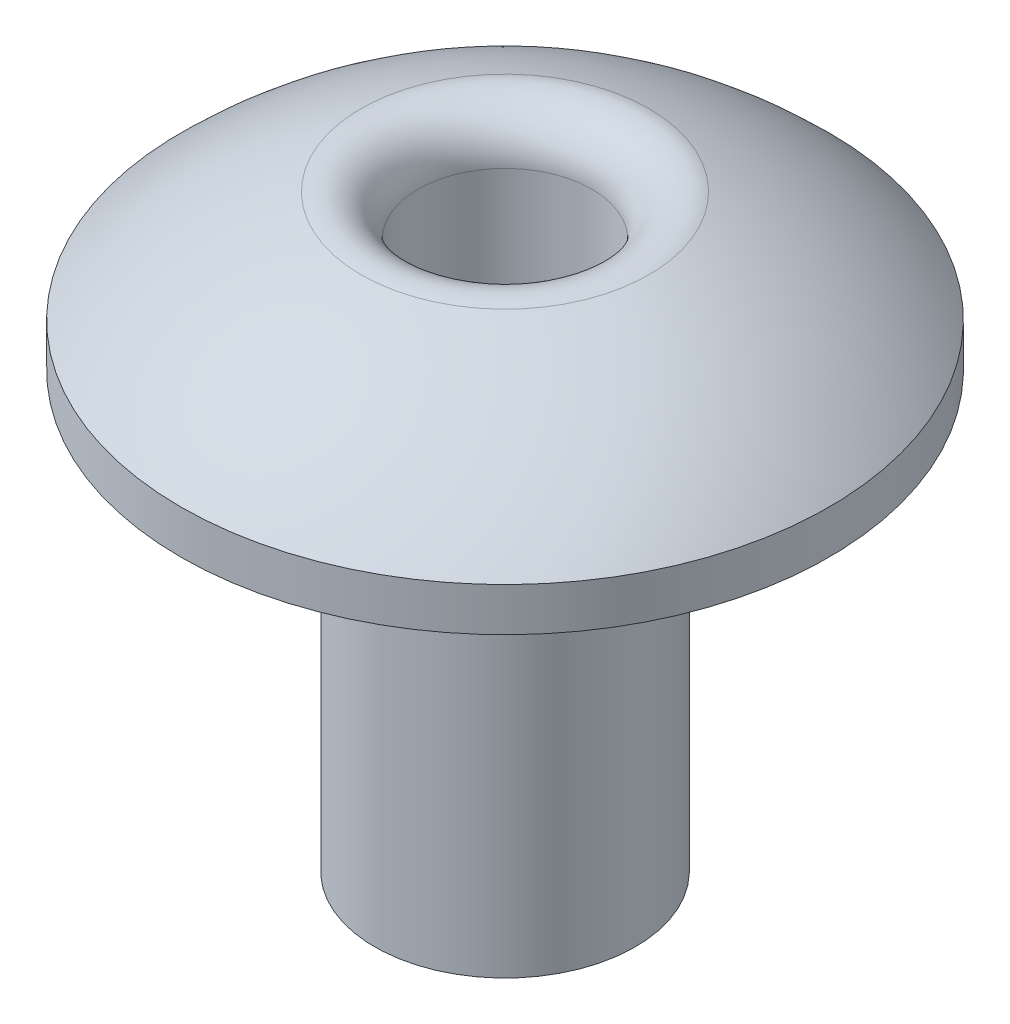
ISO-10303-21;
HEADER;
FILE_DESCRIPTION(('STEP AP214'),'2;1');
FILE_NAME('part.step','',(''),(''),'','','');
FILE_SCHEMA(('AUTOMOTIVE_DESIGN { 1 0 10303 214 1 1 1 1 }'));
ENDSEC;
DATA;
#1=APPLICATION_CONTEXT('core data for automotive mechanical design processes');
#2=APPLICATION_PROTOCOL_DEFINITION('international standard','automotive_design',2000,#1);
#3=PRODUCT_CONTEXT('',#1,'mechanical');
#4=PRODUCT('Part','Part','',(#3));
#5=PRODUCT_RELATED_PRODUCT_CATEGORY('part','',(#4));
#6=PRODUCT_DEFINITION_FORMATION('','',#4);
#7=PRODUCT_DEFINITION_CONTEXT('part definition',#1,'design');
#8=PRODUCT_DEFINITION('design','',#6,#7);
#9=PRODUCT_DEFINITION_SHAPE('','',#8);
#10=(LENGTH_UNIT() NAMED_UNIT(*) SI_UNIT(.MILLI.,.METRE.));
#11=(NAMED_UNIT(*) PLANE_ANGLE_UNIT() SI_UNIT($,.RADIAN.));
#12=(NAMED_UNIT(*) SI_UNIT($,.STERADIAN.) SOLID_ANGLE_UNIT());
#13=UNCERTAINTY_MEASURE_WITH_UNIT(LENGTH_MEASURE(1.E-05),#10,'distance_accuracy_value','');
#14=(GEOMETRIC_REPRESENTATION_CONTEXT(3) GLOBAL_UNCERTAINTY_ASSIGNED_CONTEXT((#13)) GLOBAL_UNIT_ASSIGNED_CONTEXT((#10,
#11,#12)) REPRESENTATION_CONTEXT('',''));
#15=CARTESIAN_POINT('',(0.,0.,0.));
#16=DIRECTION('',(0.,0.,1.));
#17=DIRECTION('',(1.,0.,0.));
#18=AXIS2_PLACEMENT_3D('',#15,#16,#17);
#19=CARTESIAN_POINT('',(0.,-3.73072489628794,2.22044604925031E-13));
#20=DIRECTION('',(0.,-0.999999999999998,0.));
#21=DIRECTION('',(0.,0.,1.));
#22=AXIS2_PLACEMENT_3D('',#19,#20,#21);
#23=SPHERICAL_SURFACE('',#22,5.27604174581337);
#24=CARTESIAN_POINT('',(1.38777878078145E-13,1.27835241179298,0.));
#25=DIRECTION('',(0.,-0.999999999999998,0.));
#26=DIRECTION('',(0.,0.,-1.));
#27=AXIS2_PLACEMENT_3D('',#24,#25,#26);
#28=CIRCLE('',#27,1.65703380328646);
#29=CARTESIAN_POINT('',(1.37812047610624E-13,1.27835241179298,-1.65703380328653));
#30=VERTEX_POINT('',#29);
#31=EDGE_CURVE('E54',#30,#30,#28,.T.);
#32=ORIENTED_EDGE('',*,*,#31,.T.);
#33=EDGE_LOOP('',(#32));
#34=FACE_BOUND('',#33,.T.);
#35=CARTESIAN_POINT('',(0.,0.,0.));
#36=DIRECTION('',(0.,-0.999999999999998,0.));
#37=DIRECTION('',(0.,0.,-1.));
#38=AXIS2_PLACEMENT_3D('',#35,#36,#37);
#39=CIRCLE('',#38,3.73072489628794);
#40=CARTESIAN_POINT('',(0.,0.,-3.73072489628795));
#41=VERTEX_POINT('',#40);
#42=EDGE_CURVE('E67',#41,#41,#39,.T.);
#43=ORIENTED_EDGE('',*,*,#42,.F.);
#44=EDGE_LOOP('',(#43));
#45=FACE_BOUND('',#44,.T.);
#46=ADVANCED_FACE('F47',(#34,#45),#23,.T.);
#47=CARTESIAN_POINT('',(0.,-0.500000000002956,3.73072489628803));
#48=DIRECTION('',(0.,0.999999999999998,0.));
#49=DIRECTION('',(0.,0.,1.));
#50=AXIS2_PLACEMENT_3D('',#47,#48,#49);
#51=PLANE('',#50);
#52=CARTESIAN_POINT('',(0.,-0.500000000002915,0.));
#53=DIRECTION('',(0.,-0.999999999999998,0.));
#54=DIRECTION('',(0.,0.,-1.));
#55=AXIS2_PLACEMENT_3D('',#52,#53,#54);
#56=CIRCLE('',#55,1.5);
#57=CARTESIAN_POINT('',(0.,-0.500000000002915,-1.50000000000001));
#58=VERTEX_POINT('',#57);
#59=EDGE_CURVE('E58',#58,#58,#56,.T.);
#60=ORIENTED_EDGE('',*,*,#59,.F.);
#61=EDGE_LOOP('',(#60));
#62=FACE_BOUND('',#61,.T.);
#63=CARTESIAN_POINT('',(0.,-0.5,0.));
#64=DIRECTION('',(0.,-0.999999999999998,0.));
#65=DIRECTION('',(0.,0.,-1.));
#66=AXIS2_PLACEMENT_3D('',#63,#64,#65);
#67=CIRCLE('',#66,3.73072489628794);
#68=CARTESIAN_POINT('',(0.,-0.5,-3.73072489628795));
#69=VERTEX_POINT('',#68);
#70=EDGE_CURVE('E62',#69,#69,#67,.T.);
#71=ORIENTED_EDGE('',*,*,#70,.T.);
#72=EDGE_LOOP('',(#71));
#73=FACE_BOUND('',#72,.T.);
#74=ADVANCED_FACE('F92',(#62,#73),#51,.F.);
#75=CARTESIAN_POINT('',(0.,-0.500000000005843,0.));
#76=DIRECTION('',(0.,-0.999999999999998,0.));
#77=DIRECTION('',(0.,0.,-1.));
#78=AXIS2_PLACEMENT_3D('',#75,#76,#77);
#79=CYLINDRICAL_SURFACE('',#78,3.73072489628794);
#80=ORIENTED_EDGE('',*,*,#70,.F.);
#81=EDGE_LOOP('',(#80));
#82=FACE_BOUND('',#81,.T.);
#83=ORIENTED_EDGE('',*,*,#42,.T.);
#84=EDGE_LOOP('',(#83));
#85=FACE_BOUND('',#84,.T.);
#86=ADVANCED_FACE('F88',(#82,#85),#79,.T.);
#87=CARTESIAN_POINT('',(0.,-5.50000000000292,0.));
#88=DIRECTION('',(0.,0.999999999999998,0.));
#89=DIRECTION('',(0.,0.,1.));
#90=AXIS2_PLACEMENT_3D('',#87,#88,#89);
#91=CYLINDRICAL_SURFACE('',#90,1.5);
#92=CARTESIAN_POINT('',(0.,-5.50000000000292,0.));
#93=DIRECTION('',(0.,-0.999999999999998,0.));
#94=DIRECTION('',(0.,0.,-1.));
#95=AXIS2_PLACEMENT_3D('',#92,#93,#94);
#96=CIRCLE('',#95,1.5);
#97=CARTESIAN_POINT('',(0.,-5.50000000000292,-1.50000000000003));
#98=VERTEX_POINT('',#97);
#99=EDGE_CURVE('E69',#98,#98,#96,.T.);
#100=ORIENTED_EDGE('',*,*,#99,.F.);
#101=EDGE_LOOP('',(#100));
#102=FACE_BOUND('',#101,.T.);
#103=ORIENTED_EDGE('',*,*,#59,.T.);
#104=EDGE_LOOP('',(#103));
#105=FACE_BOUND('',#104,.T.);
#106=ADVANCED_FACE('F82',(#102,#105),#91,.T.);
#107=CARTESIAN_POINT('',(0.,-5.50000000000292,0.));
#108=DIRECTION('',(0.,-0.999999999999998,0.));
#109=DIRECTION('',(0.,0.,-1.));
#110=AXIS2_PLACEMENT_3D('',#107,#108,#109);
#111=PLANE('',#110);
#112=CARTESIAN_POINT('',(0.,-5.50000000000292,0.));
#113=DIRECTION('',(0.,-0.999999999999998,0.));
#114=DIRECTION('',(0.,0.,-1.));
#115=AXIS2_PLACEMENT_3D('',#112,#113,#114);
#116=CIRCLE('',#115,1.);
#117=CARTESIAN_POINT('',(0.,-5.50000000000292,-1.00000000000003));
#118=VERTEX_POINT('',#117);
#119=EDGE_CURVE('E73',#118,#118,#116,.T.);
#120=ORIENTED_EDGE('',*,*,#119,.F.);
#121=EDGE_LOOP('',(#120));
#122=FACE_BOUND('',#121,.T.);
#123=ORIENTED_EDGE('',*,*,#99,.T.);
#124=EDGE_LOOP('',(#123));
#125=FACE_BOUND('',#124,.T.);
#126=ADVANCED_FACE('F79',(#122,#125),#111,.T.);
#127=CARTESIAN_POINT('',(0.,1.54531684952541,0.));
#128=DIRECTION('',(0.,-0.999999999999998,0.));
#129=DIRECTION('',(0.,0.,-1.));
#130=AXIS2_PLACEMENT_3D('',#127,#128,#129);
#131=CYLINDRICAL_SURFACE('',#130,1.);
#132=CARTESIAN_POINT('',(0.,0.803652101465102,1.11022302462516E-13));
#133=DIRECTION('',(0.,-0.999999999999998,0.));
#134=DIRECTION('',(0.,0.,-1.));
#135=AXIS2_PLACEMENT_3D('',#132,#133,#134);
#136=CIRCLE('',#135,1.);
#137=CARTESIAN_POINT('',(0.,0.803652101465102,-0.999999999999892));
#138=VERTEX_POINT('',#137);
#139=EDGE_CURVE('E12',#138,#138,#136,.F.);
#140=ORIENTED_EDGE('',*,*,#139,.T.);
#141=EDGE_LOOP('',(#140));
#142=FACE_BOUND('',#141,.T.);
#143=ORIENTED_EDGE('',*,*,#119,.T.);
#144=EDGE_LOOP('',(#143));
#145=FACE_BOUND('',#144,.T.);
#146=ADVANCED_FACE('F77',(#142,#145),#131,.F.);
#147=CARTESIAN_POINT('',(0.,0.803652101465102,1.11022302462516E-13));
#148=DIRECTION('',(0.,-0.999999999999998,0.));
#149=DIRECTION('',(0.,0.,-1.));
#150=AXIS2_PLACEMENT_3D('',#147,#148,#149);
#151=TOROIDAL_SURFACE('',#150,1.5,0.5);
#152=ORIENTED_EDGE('',*,*,#139,.F.);
#153=EDGE_LOOP('',(#152));
#154=FACE_BOUND('',#153,.T.);
#155=ORIENTED_EDGE('',*,*,#31,.F.);
#156=EDGE_LOOP('',(#155));
#157=FACE_BOUND('',#156,.T.);
#158=ADVANCED_FACE('F49',(#154,#157),#151,.T.);
#159=CLOSED_SHELL('',(#46,#74,#86,#106,#126,#146,#158));
#160=MANIFOLD_SOLID_BREP('B2',#159);
#161=ADVANCED_BREP_SHAPE_REPRESENTATION('',(#18,#160),#14);
#162=SHAPE_DEFINITION_REPRESENTATION(#9,#161);
ENDSEC;
END-ISO-10303-21;
